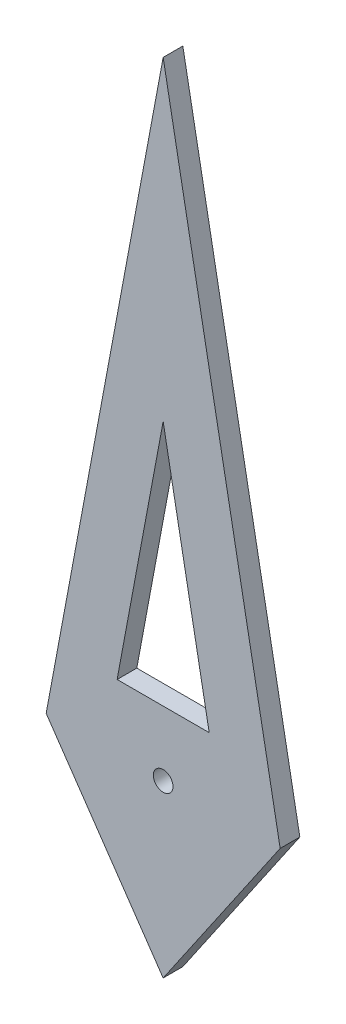
ISO-10303-21;
HEADER;
FILE_DESCRIPTION(('STEP AP214'),'2;1');
FILE_NAME('part.step','',(''),(''),'','','');
FILE_SCHEMA(('AUTOMOTIVE_DESIGN { 1 0 10303 214 1 1 1 1 }'));
ENDSEC;
DATA;
#1=APPLICATION_CONTEXT('core data for automotive mechanical design processes');
#2=APPLICATION_PROTOCOL_DEFINITION('international standard','automotive_design',2000,#1);
#3=PRODUCT_CONTEXT('',#1,'mechanical');
#4=PRODUCT('Part','Part','',(#3));
#5=PRODUCT_RELATED_PRODUCT_CATEGORY('part','',(#4));
#6=PRODUCT_DEFINITION_FORMATION('','',#4);
#7=PRODUCT_DEFINITION_CONTEXT('part definition',#1,'design');
#8=PRODUCT_DEFINITION('design','',#6,#7);
#9=PRODUCT_DEFINITION_SHAPE('','',#8);
#10=(LENGTH_UNIT() NAMED_UNIT(*) SI_UNIT(.MILLI.,.METRE.));
#11=(NAMED_UNIT(*) PLANE_ANGLE_UNIT() SI_UNIT($,.RADIAN.));
#12=(NAMED_UNIT(*) SI_UNIT($,.STERADIAN.) SOLID_ANGLE_UNIT());
#13=UNCERTAINTY_MEASURE_WITH_UNIT(LENGTH_MEASURE(1.E-05),#10,'distance_accuracy_value','');
#14=(GEOMETRIC_REPRESENTATION_CONTEXT(3) GLOBAL_UNCERTAINTY_ASSIGNED_CONTEXT((#13)) GLOBAL_UNIT_ASSIGNED_CONTEXT((#10,
#11,#12)) REPRESENTATION_CONTEXT('',''));
#15=CARTESIAN_POINT('',(0.,0.,0.));
#16=DIRECTION('',(0.,0.,1.));
#17=DIRECTION('',(1.,0.,0.));
#18=AXIS2_PLACEMENT_3D('',#15,#16,#17);
#19=CARTESIAN_POINT('',(-0.594549458678704,0.,0.1));
#20=DIRECTION('',(0.,0.,1.));
#21=DIRECTION('',(1.,0.,0.));
#22=AXIS2_PLACEMENT_3D('',#19,#20,#21);
#23=PLANE('',#22);
#24=CARTESIAN_POINT('',(0.,0.,0.1));
#25=DIRECTION('',(0.,0.,1.));
#26=DIRECTION('',(1.,0.,0.));
#27=AXIS2_PLACEMENT_3D('',#24,#25,#26);
#28=CIRCLE('',#27,0.0499999999999996);
#29=CARTESIAN_POINT('',(0.0499999999999996,0.,0.1));
#30=VERTEX_POINT('',#29);
#31=EDGE_CURVE('E119',#30,#30,#28,.T.);
#32=ORIENTED_EDGE('',*,*,#31,.F.);
#33=EDGE_LOOP('',(#32));
#34=FACE_BOUND('',#33,.T.);
#35=DIRECTION('',(-0.183556382283422,-0.983009183336057,0.));
#36=VECTOR('',#35,1.);
#37=CARTESIAN_POINT('',(0.,3.18402210022982,0.1));
#38=LINE('',#37,#36);
#39=CARTESIAN_POINT('',(0.,3.18402210022982,0.1));
#40=VERTEX_POINT('',#39);
#41=CARTESIAN_POINT('',(-0.594549458678705,0.,0.1));
#42=VERTEX_POINT('',#41);
#43=EDGE_CURVE('E125',#40,#42,#38,.T.);
#44=ORIENTED_EDGE('',*,*,#43,.T.);
#45=DIRECTION('',(0.56529849686288,-0.824886422148267,0.));
#46=VECTOR('',#45,1.);
#47=CARTESIAN_POINT('',(-0.594549458678705,0.,0.1));
#48=LINE('',#47,#46);
#49=CARTESIAN_POINT('',(0.,-0.867569573387044,0.1));
#50=VERTEX_POINT('',#49);
#51=EDGE_CURVE('E128',#42,#50,#48,.T.);
#52=ORIENTED_EDGE('',*,*,#51,.T.);
#53=DIRECTION('',(0.56529849686288,0.824886422148267,0.));
#54=VECTOR('',#53,1.);
#55=CARTESIAN_POINT('',(0.594549458678705,0.,0.1));
#56=LINE('',#55,#54);
#57=CARTESIAN_POINT('',(0.594549458678705,0.,0.1));
#58=VERTEX_POINT('',#57);
#59=EDGE_CURVE('E131',#50,#58,#56,.T.);
#60=ORIENTED_EDGE('',*,*,#59,.T.);
#61=DIRECTION('',(-0.183556382283422,0.983009183336057,0.));
#62=VECTOR('',#61,1.);
#63=CARTESIAN_POINT('',(0.,3.18402210022982,0.1));
#64=LINE('',#63,#62);
#65=EDGE_CURVE('E133',#58,#40,#64,.T.);
#66=ORIENTED_EDGE('',*,*,#65,.T.);
#67=EDGE_LOOP('',(#44,#52,#60,#66));
#68=FACE_BOUND('',#67,.T.);
#69=DIRECTION('',(-0.183556382283422,-0.983009183336057,0.));
#70=VECTOR('',#69,1.);
#71=CARTESIAN_POINT('',(-0.233954096267335,0.329177116360275,0.1));
#72=LINE('',#71,#70);
#73=CARTESIAN_POINT('',(0.,1.58208383771185,0.1));
#74=VERTEX_POINT('',#73);
#75=CARTESIAN_POINT('',(-0.233954096267335,0.329177116360275,0.1));
#76=VERTEX_POINT('',#75);
#77=EDGE_CURVE('E100',#74,#76,#72,.T.);
#78=ORIENTED_EDGE('',*,*,#77,.F.);
#79=DIRECTION('',(-0.183556382283422,0.983009183336057,0.));
#80=VECTOR('',#79,1.);
#81=CARTESIAN_POINT('',(0.233954096267335,0.329177116360275,0.1));
#82=LINE('',#81,#80);
#83=CARTESIAN_POINT('',(0.233954096267335,0.329177116360275,0.1));
#84=VERTEX_POINT('',#83);
#85=EDGE_CURVE('E92',#84,#74,#82,.T.);
#86=ORIENTED_EDGE('',*,*,#85,.F.);
#87=DIRECTION('',(1.,0.,0.));
#88=VECTOR('',#87,1.);
#89=CARTESIAN_POINT('',(-0.233954096267335,0.329177116360275,0.1));
#90=LINE('',#89,#88);
#91=EDGE_CURVE('E109',#76,#84,#90,.T.);
#92=ORIENTED_EDGE('',*,*,#91,.F.);
#93=EDGE_LOOP('',(#78,#86,#92));
#94=FACE_BOUND('',#93,.T.);
#95=ADVANCED_FACE('F33',(#34,#68,#94),#23,.T.);
#96=CARTESIAN_POINT('',(-0.594549458678704,0.,0.));
#97=DIRECTION('',(0.,0.,1.));
#98=DIRECTION('',(1.,0.,0.));
#99=AXIS2_PLACEMENT_3D('',#96,#97,#98);
#100=PLANE('',#99);
#101=CARTESIAN_POINT('',(0.,0.,0.));
#102=DIRECTION('',(0.,0.,1.));
#103=DIRECTION('',(1.,0.,0.));
#104=AXIS2_PLACEMENT_3D('',#101,#102,#103);
#105=CIRCLE('',#104,0.0499999999999996);
#106=CARTESIAN_POINT('',(0.0499999999999996,0.,0.));
#107=VERTEX_POINT('',#106);
#108=EDGE_CURVE('E107',#107,#107,#105,.T.);
#109=ORIENTED_EDGE('',*,*,#108,.T.);
#110=EDGE_LOOP('',(#109));
#111=FACE_BOUND('',#110,.T.);
#112=DIRECTION('',(-0.183556382283422,-0.983009183336057,0.));
#113=VECTOR('',#112,1.);
#114=CARTESIAN_POINT('',(0.,3.18402210022982,0.));
#115=LINE('',#114,#113);
#116=CARTESIAN_POINT('',(0.,3.18402210022982,0.));
#117=VERTEX_POINT('',#116);
#118=CARTESIAN_POINT('',(-0.594549458678705,0.,0.));
#119=VERTEX_POINT('',#118);
#120=EDGE_CURVE('E122',#117,#119,#115,.T.);
#121=ORIENTED_EDGE('',*,*,#120,.F.);
#122=DIRECTION('',(-0.183556382283422,0.983009183336057,0.));
#123=VECTOR('',#122,1.);
#124=CARTESIAN_POINT('',(0.,3.18402210022982,0.));
#125=LINE('',#124,#123);
#126=CARTESIAN_POINT('',(0.594549458678705,0.,0.));
#127=VERTEX_POINT('',#126);
#128=EDGE_CURVE('E129',#127,#117,#125,.T.);
#129=ORIENTED_EDGE('',*,*,#128,.F.);
#130=DIRECTION('',(0.56529849686288,0.824886422148267,0.));
#131=VECTOR('',#130,1.);
#132=CARTESIAN_POINT('',(0.594549458678705,0.,0.));
#133=LINE('',#132,#131);
#134=CARTESIAN_POINT('',(0.,-0.867569573387044,0.));
#135=VERTEX_POINT('',#134);
#136=EDGE_CURVE('E140',#135,#127,#133,.T.);
#137=ORIENTED_EDGE('',*,*,#136,.F.);
#138=DIRECTION('',(0.56529849686288,-0.824886422148267,0.));
#139=VECTOR('',#138,1.);
#140=CARTESIAN_POINT('',(-0.594549458678705,0.,0.));
#141=LINE('',#140,#139);
#142=EDGE_CURVE('E138',#119,#135,#141,.T.);
#143=ORIENTED_EDGE('',*,*,#142,.F.);
#144=EDGE_LOOP('',(#121,#129,#137,#143));
#145=FACE_BOUND('',#144,.T.);
#146=DIRECTION('',(-0.183556382283422,0.983009183336057,0.));
#147=VECTOR('',#146,1.);
#148=CARTESIAN_POINT('',(0.233954096267335,0.329177116360275,0.));
#149=LINE('',#148,#147);
#150=CARTESIAN_POINT('',(0.233954096267335,0.329177116360275,0.));
#151=VERTEX_POINT('',#150);
#152=CARTESIAN_POINT('',(0.,1.58208383771185,0.));
#153=VERTEX_POINT('',#152);
#154=EDGE_CURVE('E56',#151,#153,#149,.T.);
#155=ORIENTED_EDGE('',*,*,#154,.T.);
#156=DIRECTION('',(-0.183556382283422,-0.983009183336057,0.));
#157=VECTOR('',#156,1.);
#158=CARTESIAN_POINT('',(-0.233954096267335,0.329177116360275,0.));
#159=LINE('',#158,#157);
#160=CARTESIAN_POINT('',(-0.233954096267335,0.329177116360275,0.));
#161=VERTEX_POINT('',#160);
#162=EDGE_CURVE('E106',#153,#161,#159,.T.);
#163=ORIENTED_EDGE('',*,*,#162,.T.);
#164=DIRECTION('',(1.,0.,0.));
#165=VECTOR('',#164,1.);
#166=CARTESIAN_POINT('',(-0.233954096267335,0.329177116360275,0.));
#167=LINE('',#166,#165);
#168=EDGE_CURVE('E101',#161,#151,#167,.T.);
#169=ORIENTED_EDGE('',*,*,#168,.T.);
#170=EDGE_LOOP('',(#155,#163,#169));
#171=FACE_BOUND('',#170,.T.);
#172=ADVANCED_FACE('F158',(#111,#145,#171),#100,.F.);
#173=CARTESIAN_POINT('',(0.,3.18402210022982,0.1));
#174=DIRECTION('',(0.983009183336057,-0.183556382283422,0.));
#175=DIRECTION('',(0.183556382283422,0.983009183336057,0.));
#176=AXIS2_PLACEMENT_3D('',#173,#174,#175);
#177=PLANE('',#176);
#178=ORIENTED_EDGE('',*,*,#120,.T.);
#179=DIRECTION('',(0.,0.,-1.));
#180=VECTOR('',#179,1.);
#181=CARTESIAN_POINT('',(-0.594549458678705,0.,0.1));
#182=LINE('',#181,#180);
#183=EDGE_CURVE('E11',#42,#119,#182,.T.);
#184=ORIENTED_EDGE('',*,*,#183,.F.);
#185=ORIENTED_EDGE('',*,*,#43,.F.);
#186=DIRECTION('',(0.,0.,-1.));
#187=VECTOR('',#186,1.);
#188=CARTESIAN_POINT('',(0.,3.18402210022982,0.1));
#189=LINE('',#188,#187);
#190=EDGE_CURVE('E135',#40,#117,#189,.T.);
#191=ORIENTED_EDGE('',*,*,#190,.T.);
#192=EDGE_LOOP('',(#178,#184,#185,#191));
#193=FACE_BOUND('',#192,.T.);
#194=ADVANCED_FACE('F35',(#193),#177,.F.);
#195=CARTESIAN_POINT('',(-0.594549458678705,0.,0.1));
#196=DIRECTION('',(0.824886422148267,0.56529849686288,0.));
#197=DIRECTION('',(-0.56529849686288,0.824886422148267,0.));
#198=AXIS2_PLACEMENT_3D('',#195,#196,#197);
#199=PLANE('',#198);
#200=ORIENTED_EDGE('',*,*,#142,.T.);
#201=DIRECTION('',(0.,0.,-1.));
#202=VECTOR('',#201,1.);
#203=CARTESIAN_POINT('',(0.,-0.867569573387044,0.1));
#204=LINE('',#203,#202);
#205=EDGE_CURVE('E41',#50,#135,#204,.T.);
#206=ORIENTED_EDGE('',*,*,#205,.F.);
#207=ORIENTED_EDGE('',*,*,#51,.F.);
#208=ORIENTED_EDGE('',*,*,#183,.T.);
#209=EDGE_LOOP('',(#200,#206,#207,#208));
#210=FACE_BOUND('',#209,.T.);
#211=ADVANCED_FACE('F168',(#210),#199,.F.);
#212=CARTESIAN_POINT('',(0.594549458678705,0.,0.1));
#213=DIRECTION('',(-0.824886422148267,0.56529849686288,0.));
#214=DIRECTION('',(-0.56529849686288,-0.824886422148267,0.));
#215=AXIS2_PLACEMENT_3D('',#212,#213,#214);
#216=PLANE('',#215);
#217=ORIENTED_EDGE('',*,*,#136,.T.);
#218=DIRECTION('',(0.,0.,-1.));
#219=VECTOR('',#218,1.);
#220=CARTESIAN_POINT('',(0.594549458678705,0.,0.1));
#221=LINE('',#220,#219);
#222=EDGE_CURVE('E145',#58,#127,#221,.T.);
#223=ORIENTED_EDGE('',*,*,#222,.F.);
#224=ORIENTED_EDGE('',*,*,#59,.F.);
#225=ORIENTED_EDGE('',*,*,#205,.T.);
#226=EDGE_LOOP('',(#217,#223,#224,#225));
#227=FACE_BOUND('',#226,.T.);
#228=ADVANCED_FACE('F152',(#227),#216,.F.);
#229=CARTESIAN_POINT('',(0.,3.18402210022982,0.1));
#230=DIRECTION('',(-0.983009183336057,-0.183556382283422,0.));
#231=DIRECTION('',(0.183556382283422,-0.983009183336057,0.));
#232=AXIS2_PLACEMENT_3D('',#229,#230,#231);
#233=PLANE('',#232);
#234=ORIENTED_EDGE('',*,*,#128,.T.);
#235=ORIENTED_EDGE('',*,*,#190,.F.);
#236=ORIENTED_EDGE('',*,*,#65,.F.);
#237=ORIENTED_EDGE('',*,*,#222,.T.);
#238=EDGE_LOOP('',(#234,#235,#236,#237));
#239=FACE_BOUND('',#238,.T.);
#240=ADVANCED_FACE('F162',(#239),#233,.F.);
#241=CARTESIAN_POINT('',(0.,0.,0.1));
#242=DIRECTION('',(0.,0.,-1.));
#243=DIRECTION('',(-1.,0.,0.));
#244=AXIS2_PLACEMENT_3D('',#241,#242,#243);
#245=CYLINDRICAL_SURFACE('',#244,0.0499999999999996);
#246=ORIENTED_EDGE('',*,*,#31,.T.);
#247=EDGE_LOOP('',(#246));
#248=FACE_BOUND('',#247,.T.);
#249=ORIENTED_EDGE('',*,*,#108,.F.);
#250=EDGE_LOOP('',(#249));
#251=FACE_BOUND('',#250,.T.);
#252=ADVANCED_FACE('F185',(#248,#251),#245,.F.);
#253=CARTESIAN_POINT('',(0.233954096267335,0.329177116360275,0.1));
#254=DIRECTION('',(-0.983009183336057,-0.183556382283422,0.));
#255=DIRECTION('',(0.183556382283422,-0.983009183336057,0.));
#256=AXIS2_PLACEMENT_3D('',#253,#254,#255);
#257=PLANE('',#256);
#258=ORIENTED_EDGE('',*,*,#154,.F.);
#259=DIRECTION('',(0.,0.,-1.));
#260=VECTOR('',#259,1.);
#261=CARTESIAN_POINT('',(0.233954096267335,0.329177116360275,0.1));
#262=LINE('',#261,#260);
#263=EDGE_CURVE('E96',#84,#151,#262,.T.);
#264=ORIENTED_EDGE('',*,*,#263,.F.);
#265=ORIENTED_EDGE('',*,*,#85,.T.);
#266=DIRECTION('',(0.,0.,-1.));
#267=VECTOR('',#266,1.);
#268=CARTESIAN_POINT('',(0.,1.58208383771185,0.1));
#269=LINE('',#268,#267);
#270=EDGE_CURVE('E95',#74,#153,#269,.T.);
#271=ORIENTED_EDGE('',*,*,#270,.T.);
#272=EDGE_LOOP('',(#258,#264,#265,#271));
#273=FACE_BOUND('',#272,.T.);
#274=ADVANCED_FACE('F94',(#273),#257,.T.);
#275=CARTESIAN_POINT('',(-0.233954096267335,0.329177116360275,0.1));
#276=DIRECTION('',(0.983009183336057,-0.183556382283422,0.));
#277=DIRECTION('',(0.183556382283422,0.983009183336057,0.));
#278=AXIS2_PLACEMENT_3D('',#275,#276,#277);
#279=PLANE('',#278);
#280=ORIENTED_EDGE('',*,*,#162,.F.);
#281=ORIENTED_EDGE('',*,*,#270,.F.);
#282=ORIENTED_EDGE('',*,*,#77,.T.);
#283=DIRECTION('',(0.,0.,-1.));
#284=VECTOR('',#283,1.);
#285=CARTESIAN_POINT('',(-0.233954096267335,0.329177116360275,0.1));
#286=LINE('',#285,#284);
#287=EDGE_CURVE('E48',#76,#161,#286,.T.);
#288=ORIENTED_EDGE('',*,*,#287,.T.);
#289=EDGE_LOOP('',(#280,#281,#282,#288));
#290=FACE_BOUND('',#289,.T.);
#291=ADVANCED_FACE('F104',(#290),#279,.T.);
#292=CARTESIAN_POINT('',(-0.233954096267335,0.329177116360275,0.1));
#293=DIRECTION('',(0.,1.,0.));
#294=DIRECTION('',(-1.,0.,0.));
#295=AXIS2_PLACEMENT_3D('',#292,#293,#294);
#296=PLANE('',#295);
#297=ORIENTED_EDGE('',*,*,#168,.F.);
#298=ORIENTED_EDGE('',*,*,#287,.F.);
#299=ORIENTED_EDGE('',*,*,#91,.T.);
#300=ORIENTED_EDGE('',*,*,#263,.T.);
#301=EDGE_LOOP('',(#297,#298,#299,#300));
#302=FACE_BOUND('',#301,.T.);
#303=ADVANCED_FACE('F201',(#302),#296,.T.);
#304=CLOSED_SHELL('',(#95,#172,#194,#211,#228,#240,#252,#274,#291,#303));
#305=MANIFOLD_SOLID_BREP('B2',#304);
#306=ADVANCED_BREP_SHAPE_REPRESENTATION('',(#18,#305),#14);
#307=SHAPE_DEFINITION_REPRESENTATION(#9,#306);
ENDSEC;
END-ISO-10303-21;
